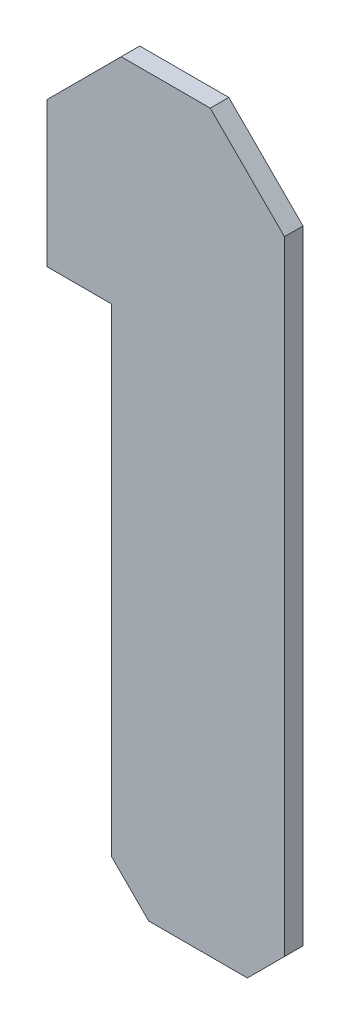
ISO-10303-21;
HEADER;
FILE_DESCRIPTION(('STEP AP214'),'2;1');
FILE_NAME('part.step','',(''),(''),'','','');
FILE_SCHEMA(('AUTOMOTIVE_DESIGN { 1 0 10303 214 1 1 1 1 }'));
ENDSEC;
DATA;
#1=APPLICATION_CONTEXT('core data for automotive mechanical design processes');
#2=APPLICATION_PROTOCOL_DEFINITION('international standard','automotive_design',2000,#1);
#3=PRODUCT_CONTEXT('',#1,'mechanical');
#4=PRODUCT('Part','Part','',(#3));
#5=PRODUCT_RELATED_PRODUCT_CATEGORY('part','',(#4));
#6=PRODUCT_DEFINITION_FORMATION('','',#4);
#7=PRODUCT_DEFINITION_CONTEXT('part definition',#1,'design');
#8=PRODUCT_DEFINITION('design','',#6,#7);
#9=PRODUCT_DEFINITION_SHAPE('','',#8);
#10=(LENGTH_UNIT() NAMED_UNIT(*) SI_UNIT(.MILLI.,.METRE.));
#11=(NAMED_UNIT(*) PLANE_ANGLE_UNIT() SI_UNIT($,.RADIAN.));
#12=(NAMED_UNIT(*) SI_UNIT($,.STERADIAN.) SOLID_ANGLE_UNIT());
#13=UNCERTAINTY_MEASURE_WITH_UNIT(LENGTH_MEASURE(1.E-05),#10,'distance_accuracy_value','');
#14=(GEOMETRIC_REPRESENTATION_CONTEXT(3) GLOBAL_UNCERTAINTY_ASSIGNED_CONTEXT((#13)) GLOBAL_UNIT_ASSIGNED_CONTEXT((#10,
#11,#12)) REPRESENTATION_CONTEXT('',''));
#15=CARTESIAN_POINT('',(0.,0.,0.));
#16=DIRECTION('',(0.,0.,1.));
#17=DIRECTION('',(1.,0.,0.));
#18=AXIS2_PLACEMENT_3D('',#15,#16,#17);
#19=CARTESIAN_POINT('',(6.4,3.15,0.5));
#20=DIRECTION('',(-0.707106781186546,-0.707106781186549,0.));
#21=DIRECTION('',(0.707106781186549,-0.707106781186546,0.));
#22=AXIS2_PLACEMENT_3D('',#19,#20,#21);
#23=PLANE('',#22);
#24=DIRECTION('',(-0.707106781186549,0.707106781186546,0.));
#25=VECTOR('',#24,1.);
#26=CARTESIAN_POINT('',(6.4,3.15,0.));
#27=LINE('',#26,#25);
#28=CARTESIAN_POINT('',(6.4,3.15,0.));
#29=VERTEX_POINT('',#28);
#30=CARTESIAN_POINT('',(4.39999999999999,5.15,0.));
#31=VERTEX_POINT('',#30);
#32=EDGE_CURVE('E141',#29,#31,#27,.T.);
#33=ORIENTED_EDGE('',*,*,#32,.T.);
#34=DIRECTION('',(0.,0.,-1.));
#35=VECTOR('',#34,1.);
#36=CARTESIAN_POINT('',(4.39999999999999,5.15,0.5));
#37=LINE('',#36,#35);
#38=CARTESIAN_POINT('',(4.39999999999999,5.15,0.5));
#39=VERTEX_POINT('',#38);
#40=EDGE_CURVE('E11',#39,#31,#37,.T.);
#41=ORIENTED_EDGE('',*,*,#40,.F.);
#42=DIRECTION('',(-0.707106781186549,0.707106781186546,0.));
#43=VECTOR('',#42,1.);
#44=CARTESIAN_POINT('',(6.4,3.15,0.5));
#45=LINE('',#44,#43);
#46=CARTESIAN_POINT('',(6.4,3.15,0.5));
#47=VERTEX_POINT('',#46);
#48=EDGE_CURVE('E161',#47,#39,#45,.T.);
#49=ORIENTED_EDGE('',*,*,#48,.F.);
#50=DIRECTION('',(0.,0.,-1.));
#51=VECTOR('',#50,1.);
#52=CARTESIAN_POINT('',(6.4,3.15,0.5));
#53=LINE('',#52,#51);
#54=EDGE_CURVE('E137',#47,#29,#53,.T.);
#55=ORIENTED_EDGE('',*,*,#54,.T.);
#56=EDGE_LOOP('',(#33,#41,#49,#55));
#57=FACE_BOUND('',#56,.T.);
#58=ADVANCED_FACE('F32',(#57),#23,.F.);
#59=CARTESIAN_POINT('',(4.39999999999999,5.15,0.5));
#60=DIRECTION('',(0.,-1.,0.));
#61=DIRECTION('',(0.,0.,-1.));
#62=AXIS2_PLACEMENT_3D('',#59,#60,#61);
#63=PLANE('',#62);
#64=DIRECTION('',(-1.,0.,0.));
#65=VECTOR('',#64,1.);
#66=CARTESIAN_POINT('',(4.39999999999999,5.15,0.));
#67=LINE('',#66,#65);
#68=CARTESIAN_POINT('',(2.,5.15,0.));
#69=VERTEX_POINT('',#68);
#70=EDGE_CURVE('E144',#31,#69,#67,.T.);
#71=ORIENTED_EDGE('',*,*,#70,.T.);
#72=DIRECTION('',(0.,0.,-1.));
#73=VECTOR('',#72,1.);
#74=CARTESIAN_POINT('',(2.,5.15,0.5));
#75=LINE('',#74,#73);
#76=CARTESIAN_POINT('',(2.,5.15,0.5));
#77=VERTEX_POINT('',#76);
#78=EDGE_CURVE('E40',#77,#69,#75,.T.);
#79=ORIENTED_EDGE('',*,*,#78,.F.);
#80=DIRECTION('',(-1.,0.,0.));
#81=VECTOR('',#80,1.);
#82=CARTESIAN_POINT('',(4.39999999999999,5.15,0.5));
#83=LINE('',#82,#81);
#84=EDGE_CURVE('E95',#39,#77,#83,.T.);
#85=ORIENTED_EDGE('',*,*,#84,.F.);
#86=ORIENTED_EDGE('',*,*,#40,.T.);
#87=EDGE_LOOP('',(#71,#79,#85,#86));
#88=FACE_BOUND('',#87,.T.);
#89=ADVANCED_FACE('F207',(#88),#63,.F.);
#90=CARTESIAN_POINT('',(2.,5.15,0.5));
#91=DIRECTION('',(0.707106781186549,-0.707106781186547,0.));
#92=DIRECTION('',(0.707106781186547,0.707106781186549,0.));
#93=AXIS2_PLACEMENT_3D('',#90,#91,#92);
#94=PLANE('',#93);
#95=DIRECTION('',(-0.707106781186547,-0.707106781186549,0.));
#96=VECTOR('',#95,1.);
#97=CARTESIAN_POINT('',(2.,5.15,0.));
#98=LINE('',#97,#96);
#99=CARTESIAN_POINT('',(0.,3.15,0.));
#100=VERTEX_POINT('',#99);
#101=EDGE_CURVE('E146',#69,#100,#98,.T.);
#102=ORIENTED_EDGE('',*,*,#101,.T.);
#103=DIRECTION('',(0.,0.,-1.));
#104=VECTOR('',#103,1.);
#105=CARTESIAN_POINT('',(0.,3.15,0.5));
#106=LINE('',#105,#104);
#107=CARTESIAN_POINT('',(0.,3.15,0.5));
#108=VERTEX_POINT('',#107);
#109=EDGE_CURVE('E174',#108,#100,#106,.T.);
#110=ORIENTED_EDGE('',*,*,#109,.F.);
#111=DIRECTION('',(-0.707106781186547,-0.707106781186549,0.));
#112=VECTOR('',#111,1.);
#113=CARTESIAN_POINT('',(2.,5.15,0.5));
#114=LINE('',#113,#112);
#115=EDGE_CURVE('E182',#77,#108,#114,.T.);
#116=ORIENTED_EDGE('',*,*,#115,.F.);
#117=ORIENTED_EDGE('',*,*,#78,.T.);
#118=EDGE_LOOP('',(#102,#110,#116,#117));
#119=FACE_BOUND('',#118,.T.);
#120=ADVANCED_FACE('F180',(#119),#94,.F.);
#121=CARTESIAN_POINT('',(0.,0.100000000000001,0.5));
#122=DIRECTION('',(1.,0.,0.));
#123=DIRECTION('',(0.,1.,0.));
#124=AXIS2_PLACEMENT_3D('',#121,#122,#123);
#125=PLANE('',#124);
#126=DIRECTION('',(0.,-1.,0.));
#127=VECTOR('',#126,1.);
#128=CARTESIAN_POINT('',(0.,0.100000000000001,0.));
#129=LINE('',#128,#127);
#130=CARTESIAN_POINT('',(0.,-0.75,0.));
#131=VERTEX_POINT('',#130);
#132=EDGE_CURVE('E149',#100,#131,#129,.T.);
#133=ORIENTED_EDGE('',*,*,#132,.T.);
#134=DIRECTION('',(0.,0.,-1.));
#135=VECTOR('',#134,1.);
#136=CARTESIAN_POINT('',(0.,-0.75,0.5));
#137=LINE('',#136,#135);
#138=CARTESIAN_POINT('',(0.,-0.75,0.5));
#139=VERTEX_POINT('',#138);
#140=EDGE_CURVE('E171',#139,#131,#137,.T.);
#141=ORIENTED_EDGE('',*,*,#140,.F.);
#142=DIRECTION('',(0.,-1.,0.));
#143=VECTOR('',#142,1.);
#144=CARTESIAN_POINT('',(0.,3.15,0.5));
#145=LINE('',#144,#143);
#146=EDGE_CURVE('E197',#108,#139,#145,.T.);
#147=ORIENTED_EDGE('',*,*,#146,.F.);
#148=ORIENTED_EDGE('',*,*,#109,.T.);
#149=EDGE_LOOP('',(#133,#141,#147,#148));
#150=FACE_BOUND('',#149,.T.);
#151=ADVANCED_FACE('F188',(#150),#125,.F.);
#152=CARTESIAN_POINT('',(0.,-0.75,0.5));
#153=DIRECTION('',(0.,1.,0.));
#154=DIRECTION('',(0.,0.,1.));
#155=AXIS2_PLACEMENT_3D('',#152,#153,#154);
#156=PLANE('',#155);
#157=DIRECTION('',(1.,0.,0.));
#158=VECTOR('',#157,1.);
#159=CARTESIAN_POINT('',(0.,-0.75,0.));
#160=LINE('',#159,#158);
#161=CARTESIAN_POINT('',(1.7422791503867,-0.75,0.));
#162=VERTEX_POINT('',#161);
#163=EDGE_CURVE('E151',#131,#162,#160,.T.);
#164=ORIENTED_EDGE('',*,*,#163,.T.);
#165=DIRECTION('',(0.,0.,-1.));
#166=VECTOR('',#165,1.);
#167=CARTESIAN_POINT('',(1.7422791503867,-0.75,0.5));
#168=LINE('',#167,#166);
#169=CARTESIAN_POINT('',(1.7422791503867,-0.75,0.5));
#170=VERTEX_POINT('',#169);
#171=EDGE_CURVE('E168',#170,#162,#168,.T.);
#172=ORIENTED_EDGE('',*,*,#171,.F.);
#173=DIRECTION('',(1.,0.,0.));
#174=VECTOR('',#173,1.);
#175=CARTESIAN_POINT('',(0.,-0.75,0.5));
#176=LINE('',#175,#174);
#177=EDGE_CURVE('E194',#139,#170,#176,.T.);
#178=ORIENTED_EDGE('',*,*,#177,.F.);
#179=ORIENTED_EDGE('',*,*,#140,.T.);
#180=EDGE_LOOP('',(#164,#172,#178,#179));
#181=FACE_BOUND('',#180,.T.);
#182=ADVANCED_FACE('F192',(#181),#156,.F.);
#183=CARTESIAN_POINT('',(1.7422791503867,-0.75,0.5));
#184=DIRECTION('',(1.,0.,0.));
#185=DIRECTION('',(0.,1.,0.));
#186=AXIS2_PLACEMENT_3D('',#183,#184,#185);
#187=PLANE('',#186);
#188=DIRECTION('',(0.,-1.,0.));
#189=VECTOR('',#188,1.);
#190=CARTESIAN_POINT('',(1.7422791503867,-0.75,0.));
#191=LINE('',#190,#189);
#192=CARTESIAN_POINT('',(1.7422791503867,-13.65,0.));
#193=VERTEX_POINT('',#192);
#194=EDGE_CURVE('E153',#162,#193,#191,.T.);
#195=ORIENTED_EDGE('',*,*,#194,.T.);
#196=DIRECTION('',(0.,0.,-1.));
#197=VECTOR('',#196,1.);
#198=CARTESIAN_POINT('',(1.7422791503867,-13.65,0.5));
#199=LINE('',#198,#197);
#200=CARTESIAN_POINT('',(1.7422791503867,-13.65,0.5));
#201=VERTEX_POINT('',#200);
#202=EDGE_CURVE('E165',#201,#193,#199,.T.);
#203=ORIENTED_EDGE('',*,*,#202,.F.);
#204=DIRECTION('',(0.,-1.,0.));
#205=VECTOR('',#204,1.);
#206=CARTESIAN_POINT('',(1.7422791503867,-0.75,0.5));
#207=LINE('',#206,#205);
#208=EDGE_CURVE('E196',#170,#201,#207,.T.);
#209=ORIENTED_EDGE('',*,*,#208,.F.);
#210=ORIENTED_EDGE('',*,*,#171,.T.);
#211=EDGE_LOOP('',(#195,#203,#209,#210));
#212=FACE_BOUND('',#211,.T.);
#213=ADVANCED_FACE('F219',(#212),#187,.F.);
#214=CARTESIAN_POINT('',(1.7422791503867,-13.65,0.5));
#215=DIRECTION('',(0.707106781186548,0.707106781186547,0.));
#216=DIRECTION('',(-0.707106781186547,0.707106781186548,0.));
#217=AXIS2_PLACEMENT_3D('',#214,#215,#216);
#218=PLANE('',#217);
#219=DIRECTION('',(0.707106781186547,-0.707106781186548,0.));
#220=VECTOR('',#219,1.);
#221=CARTESIAN_POINT('',(1.7422791503867,-13.65,0.));
#222=LINE('',#221,#220);
#223=CARTESIAN_POINT('',(2.7422791503867,-14.65,0.));
#224=VERTEX_POINT('',#223);
#225=EDGE_CURVE('E155',#193,#224,#222,.T.);
#226=ORIENTED_EDGE('',*,*,#225,.T.);
#227=DIRECTION('',(0.,0.,-1.));
#228=VECTOR('',#227,1.);
#229=CARTESIAN_POINT('',(2.7422791503867,-14.65,0.5));
#230=LINE('',#229,#228);
#231=CARTESIAN_POINT('',(2.7422791503867,-14.65,0.5));
#232=VERTEX_POINT('',#231);
#233=EDGE_CURVE('E132',#232,#224,#230,.T.);
#234=ORIENTED_EDGE('',*,*,#233,.F.);
#235=DIRECTION('',(0.707106781186547,-0.707106781186548,0.));
#236=VECTOR('',#235,1.);
#237=CARTESIAN_POINT('',(1.7422791503867,-13.65,0.5));
#238=LINE('',#237,#236);
#239=EDGE_CURVE('E121',#201,#232,#238,.T.);
#240=ORIENTED_EDGE('',*,*,#239,.F.);
#241=ORIENTED_EDGE('',*,*,#202,.T.);
#242=EDGE_LOOP('',(#226,#234,#240,#241));
#243=FACE_BOUND('',#242,.T.);
#244=ADVANCED_FACE('F222',(#243),#218,.F.);
#245=CARTESIAN_POINT('',(2.7422791503867,-14.65,0.5));
#246=DIRECTION('',(0.,1.,0.));
#247=DIRECTION('',(0.,0.,1.));
#248=AXIS2_PLACEMENT_3D('',#245,#246,#247);
#249=PLANE('',#248);
#250=DIRECTION('',(1.,0.,0.));
#251=VECTOR('',#250,1.);
#252=CARTESIAN_POINT('',(2.7422791503867,-14.65,0.));
#253=LINE('',#252,#251);
#254=CARTESIAN_POINT('',(5.4,-14.65,0.));
#255=VERTEX_POINT('',#254);
#256=EDGE_CURVE('E130',#224,#255,#253,.T.);
#257=ORIENTED_EDGE('',*,*,#256,.T.);
#258=DIRECTION('',(0.,0.,-1.));
#259=VECTOR('',#258,1.);
#260=CARTESIAN_POINT('',(5.4,-14.65,0.5));
#261=LINE('',#260,#259);
#262=CARTESIAN_POINT('',(5.4,-14.65,0.5));
#263=VERTEX_POINT('',#262);
#264=EDGE_CURVE('E127',#263,#255,#261,.T.);
#265=ORIENTED_EDGE('',*,*,#264,.F.);
#266=DIRECTION('',(1.,0.,0.));
#267=VECTOR('',#266,1.);
#268=CARTESIAN_POINT('',(2.7422791503867,-14.65,0.5));
#269=LINE('',#268,#267);
#270=EDGE_CURVE('E114',#232,#263,#269,.T.);
#271=ORIENTED_EDGE('',*,*,#270,.F.);
#272=ORIENTED_EDGE('',*,*,#233,.T.);
#273=EDGE_LOOP('',(#257,#265,#271,#272));
#274=FACE_BOUND('',#273,.T.);
#275=ADVANCED_FACE('F128',(#274),#249,.F.);
#276=CARTESIAN_POINT('',(5.4,-14.65,0.5));
#277=DIRECTION('',(-0.707106781186547,0.707106781186547,0.));
#278=DIRECTION('',(-0.707106781186548,-0.707106781186548,0.));
#279=AXIS2_PLACEMENT_3D('',#276,#277,#278);
#280=PLANE('',#279);
#281=DIRECTION('',(0.707106781186547,0.707106781186547,0.));
#282=VECTOR('',#281,1.);
#283=CARTESIAN_POINT('',(5.4,-14.65,0.));
#284=LINE('',#283,#282);
#285=CARTESIAN_POINT('',(6.4,-13.65,0.));
#286=VERTEX_POINT('',#285);
#287=EDGE_CURVE('E158',#255,#286,#284,.T.);
#288=ORIENTED_EDGE('',*,*,#287,.T.);
#289=DIRECTION('',(0.,0.,-1.));
#290=VECTOR('',#289,1.);
#291=CARTESIAN_POINT('',(6.4,-13.65,0.5));
#292=LINE('',#291,#290);
#293=CARTESIAN_POINT('',(6.4,-13.65,0.5));
#294=VERTEX_POINT('',#293);
#295=EDGE_CURVE('E133',#294,#286,#292,.T.);
#296=ORIENTED_EDGE('',*,*,#295,.F.);
#297=DIRECTION('',(0.707106781186547,0.707106781186547,0.));
#298=VECTOR('',#297,1.);
#299=CARTESIAN_POINT('',(5.4,-14.65,0.5));
#300=LINE('',#299,#298);
#301=EDGE_CURVE('E118',#263,#294,#300,.T.);
#302=ORIENTED_EDGE('',*,*,#301,.F.);
#303=ORIENTED_EDGE('',*,*,#264,.T.);
#304=EDGE_LOOP('',(#288,#296,#302,#303));
#305=FACE_BOUND('',#304,.T.);
#306=ADVANCED_FACE('F135',(#305),#280,.F.);
#307=CARTESIAN_POINT('',(6.4,3.15,0.5));
#308=DIRECTION('',(-1.,0.,0.));
#309=DIRECTION('',(0.,0.,1.));
#310=AXIS2_PLACEMENT_3D('',#307,#308,#309);
#311=PLANE('',#310);
#312=DIRECTION('',(0.,1.,0.));
#313=VECTOR('',#312,1.);
#314=CARTESIAN_POINT('',(6.4,3.15,0.));
#315=LINE('',#314,#313);
#316=EDGE_CURVE('E83',#286,#29,#315,.T.);
#317=ORIENTED_EDGE('',*,*,#316,.T.);
#318=ORIENTED_EDGE('',*,*,#54,.F.);
#319=DIRECTION('',(0.,1.,0.));
#320=VECTOR('',#319,1.);
#321=CARTESIAN_POINT('',(6.4,-13.65,0.5));
#322=LINE('',#321,#320);
#323=EDGE_CURVE('E48',#294,#47,#322,.T.);
#324=ORIENTED_EDGE('',*,*,#323,.F.);
#325=ORIENTED_EDGE('',*,*,#295,.T.);
#326=EDGE_LOOP('',(#317,#318,#324,#325));
#327=FACE_BOUND('',#326,.T.);
#328=ADVANCED_FACE('F231',(#327),#311,.F.);
#329=CARTESIAN_POINT('',(0.,0.,0.5));
#330=DIRECTION('',(0.,0.,1.));
#331=DIRECTION('',(1.,0.,0.));
#332=AXIS2_PLACEMENT_3D('',#329,#330,#331);
#333=PLANE('',#332);
#334=ORIENTED_EDGE('',*,*,#48,.T.);
#335=ORIENTED_EDGE('',*,*,#84,.T.);
#336=ORIENTED_EDGE('',*,*,#115,.T.);
#337=ORIENTED_EDGE('',*,*,#146,.T.);
#338=ORIENTED_EDGE('',*,*,#177,.T.);
#339=ORIENTED_EDGE('',*,*,#208,.T.);
#340=ORIENTED_EDGE('',*,*,#239,.T.);
#341=ORIENTED_EDGE('',*,*,#270,.T.);
#342=ORIENTED_EDGE('',*,*,#301,.T.);
#343=ORIENTED_EDGE('',*,*,#323,.T.);
#344=EDGE_LOOP('',(#334,#335,#336,#337,#338,#339,#340,#341,#342,#343));
#345=FACE_BOUND('',#344,.T.);
#346=ADVANCED_FACE('F116',(#345),#333,.T.);
#347=CARTESIAN_POINT('',(0.,0.,0.));
#348=DIRECTION('',(0.,0.,1.));
#349=DIRECTION('',(1.,0.,0.));
#350=AXIS2_PLACEMENT_3D('',#347,#348,#349);
#351=PLANE('',#350);
#352=ORIENTED_EDGE('',*,*,#32,.F.);
#353=ORIENTED_EDGE('',*,*,#316,.F.);
#354=ORIENTED_EDGE('',*,*,#287,.F.);
#355=ORIENTED_EDGE('',*,*,#256,.F.);
#356=ORIENTED_EDGE('',*,*,#225,.F.);
#357=ORIENTED_EDGE('',*,*,#194,.F.);
#358=ORIENTED_EDGE('',*,*,#163,.F.);
#359=ORIENTED_EDGE('',*,*,#132,.F.);
#360=ORIENTED_EDGE('',*,*,#101,.F.);
#361=ORIENTED_EDGE('',*,*,#70,.F.);
#362=EDGE_LOOP('',(#352,#353,#354,#355,#356,#357,#358,#359,#360,#361));
#363=FACE_BOUND('',#362,.T.);
#364=ADVANCED_FACE('F183',(#363),#351,.F.);
#365=CLOSED_SHELL('',(#58,#89,#120,#151,#182,#213,#244,#275,#306,#328,#346,#364));
#366=MANIFOLD_SOLID_BREP('B2',#365);
#367=ADVANCED_BREP_SHAPE_REPRESENTATION('',(#18,#366),#14);
#368=SHAPE_DEFINITION_REPRESENTATION(#9,#367);
ENDSEC;
END-ISO-10303-21;
